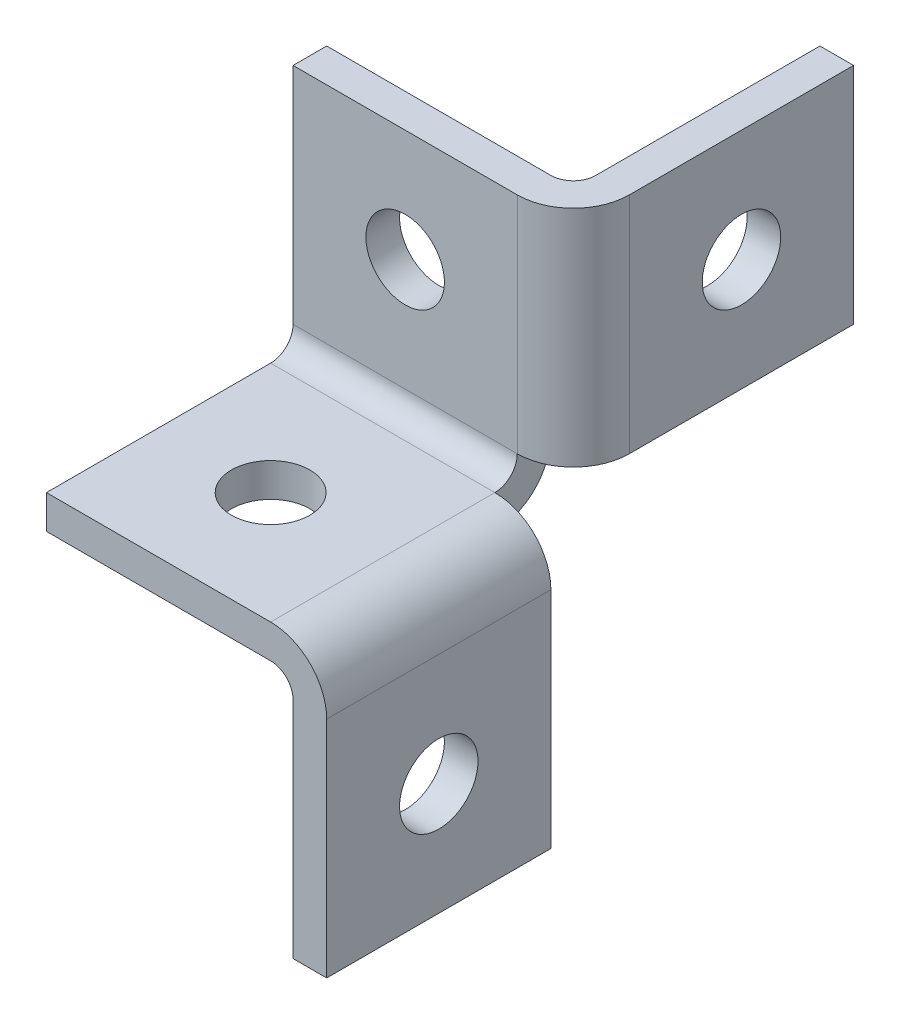
ISO-10303-21;
HEADER;
FILE_DESCRIPTION(('STEP AP214'),'2;1');
FILE_NAME('part.step','',(''),(''),'','','');
FILE_SCHEMA(('AUTOMOTIVE_DESIGN { 1 0 10303 214 1 1 1 1 }'));
ENDSEC;
DATA;
#1=APPLICATION_CONTEXT('core data for automotive mechanical design processes');
#2=APPLICATION_PROTOCOL_DEFINITION('international standard','automotive_design',2000,#1);
#3=PRODUCT_CONTEXT('',#1,'mechanical');
#4=PRODUCT('Part','Part','',(#3));
#5=PRODUCT_RELATED_PRODUCT_CATEGORY('part','',(#4));
#6=PRODUCT_DEFINITION_FORMATION('','',#4);
#7=PRODUCT_DEFINITION_CONTEXT('part definition',#1,'design');
#8=PRODUCT_DEFINITION('design','',#6,#7);
#9=PRODUCT_DEFINITION_SHAPE('','',#8);
#10=(LENGTH_UNIT() NAMED_UNIT(*) SI_UNIT(.MILLI.,.METRE.));
#11=(NAMED_UNIT(*) PLANE_ANGLE_UNIT() SI_UNIT($,.RADIAN.));
#12=(NAMED_UNIT(*) SI_UNIT($,.STERADIAN.) SOLID_ANGLE_UNIT());
#13=UNCERTAINTY_MEASURE_WITH_UNIT(LENGTH_MEASURE(1.E-05),#10,'distance_accuracy_value','');
#14=(GEOMETRIC_REPRESENTATION_CONTEXT(3) GLOBAL_UNCERTAINTY_ASSIGNED_CONTEXT((#13)) GLOBAL_UNIT_ASSIGNED_CONTEXT((#10,
#11,#12)) REPRESENTATION_CONTEXT('',''));
#15=CARTESIAN_POINT('',(0.,0.,0.));
#16=DIRECTION('',(0.,0.,1.));
#17=DIRECTION('',(1.,0.,0.));
#18=AXIS2_PLACEMENT_3D('',#15,#16,#17);
#19=CARTESIAN_POINT('',(-92.0281662206482,-24.0000000000001,-20.));
#20=DIRECTION('',(1.,0.,0.));
#21=DIRECTION('',(0.,1.,0.));
#22=AXIS2_PLACEMENT_3D('',#19,#20,#21);
#23=CYLINDRICAL_SURFACE('',#22,6.99999999999999);
#24=CARTESIAN_POINT('',(49.9999999999997,-23.9999999999998,-20.0000000000001));
#25=DIRECTION('',(1.,0.,0.));
#26=DIRECTION('',(0.,1.,0.));
#27=AXIS2_PLACEMENT_3D('',#24,#25,#26);
#28=CIRCLE('',#27,6.99999999999999);
#29=CARTESIAN_POINT('',(49.9999999999996,-16.9999999999998,-20.0000000000001));
#30=VERTEX_POINT('',#29);
#31=EDGE_CURVE('E137',#30,#30,#28,.F.);
#32=ORIENTED_EDGE('',*,*,#31,.F.);
#33=EDGE_LOOP('',(#32));
#34=FACE_BOUND('',#33,.T.);
#35=CARTESIAN_POINT('',(43.9999999999995,-23.9999999999998,-20.0000000000001));
#36=DIRECTION('',(1.,0.,0.));
#37=DIRECTION('',(0.,1.,0.));
#38=AXIS2_PLACEMENT_3D('',#35,#36,#37);
#39=CIRCLE('',#38,6.99999999999999);
#40=CARTESIAN_POINT('',(43.9999999999995,-16.9999999999999,-20.0000000000001));
#41=VERTEX_POINT('',#40);
#42=EDGE_CURVE('E20',#41,#41,#39,.T.);
#43=ORIENTED_EDGE('',*,*,#42,.F.);
#44=EDGE_LOOP('',(#43));
#45=FACE_BOUND('',#44,.T.);
#46=ADVANCED_FACE('F17',(#34,#45),#23,.F.);
#47=CARTESIAN_POINT('',(161.62652762026,30.0000000000004,-74.0000000000002));
#48=DIRECTION('',(-1.,0.,0.));
#49=DIRECTION('',(0.,-1.,0.));
#50=AXIS2_PLACEMENT_3D('',#47,#48,#49);
#51=CYLINDRICAL_SURFACE('',#50,6.99999999999999);
#52=CARTESIAN_POINT('',(43.9999999999995,30.0000000000002,-74.0000000000001));
#53=DIRECTION('',(-1.,0.,0.));
#54=DIRECTION('',(0.,-1.,0.));
#55=AXIS2_PLACEMENT_3D('',#52,#53,#54);
#56=CIRCLE('',#55,6.99999999999999);
#57=CARTESIAN_POINT('',(43.9999999999995,23.0000000000002,-74.0000000000001));
#58=VERTEX_POINT('',#57);
#59=EDGE_CURVE('E176',#58,#58,#56,.F.);
#60=ORIENTED_EDGE('',*,*,#59,.F.);
#61=EDGE_LOOP('',(#60));
#62=FACE_BOUND('',#61,.T.);
#63=CARTESIAN_POINT('',(49.9999999999994,30.0000000000002,-74.0000000000001));
#64=DIRECTION('',(-1.,0.,0.));
#65=DIRECTION('',(0.,-1.,0.));
#66=AXIS2_PLACEMENT_3D('',#63,#64,#65);
#67=CIRCLE('',#66,6.99999999999999);
#68=CARTESIAN_POINT('',(49.9999999999994,23.0000000000002,-74.0000000000001));
#69=VERTEX_POINT('',#68);
#70=EDGE_CURVE('E194',#69,#69,#67,.T.);
#71=ORIENTED_EDGE('',*,*,#70,.F.);
#72=EDGE_LOOP('',(#71));
#73=FACE_BOUND('',#72,.T.);
#74=ADVANCED_FACE('F288',(#62,#73),#51,.F.);
#75=CARTESIAN_POINT('',(39.9999999999995,-3.99999999999985,-13.5207198547634));
#76=DIRECTION('',(0.,0.,-1.));
#77=DIRECTION('',(0.,1.,0.));
#78=AXIS2_PLACEMENT_3D('',#75,#76,#77);
#79=CYLINDRICAL_SURFACE('',#78,4.);
#80=CARTESIAN_POINT('',(39.9999999999995,-3.99999999999985,-40.));
#81=DIRECTION('',(0.,0.,-1.));
#82=DIRECTION('',(0.,1.,0.));
#83=AXIS2_PLACEMENT_3D('',#80,#81,#82);
#84=CIRCLE('',#83,4.);
#85=CARTESIAN_POINT('',(43.9999999999996,-3.99999999999985,-40.));
#86=VERTEX_POINT('',#85);
#87=CARTESIAN_POINT('',(39.9999999999995,1.24466409401336E-13,-40.));
#88=VERTEX_POINT('',#87);
#89=EDGE_CURVE('E106',#86,#88,#84,.F.);
#90=ORIENTED_EDGE('',*,*,#89,.F.);
#91=DIRECTION('',(0.,0.,1.));
#92=VECTOR('',#91,1.);
#93=CARTESIAN_POINT('',(43.9999999999995,-3.99999999999985,-40.));
#94=LINE('',#93,#92);
#95=CARTESIAN_POINT('',(43.9999999999995,-3.99999999999985,0.));
#96=VERTEX_POINT('',#95);
#97=EDGE_CURVE('E138',#96,#86,#94,.F.);
#98=ORIENTED_EDGE('',*,*,#97,.F.);
#99=CARTESIAN_POINT('',(39.9999999999995,-3.99999999999985,0.));
#100=DIRECTION('',(0.,0.,-1.));
#101=DIRECTION('',(0.,1.,0.));
#102=AXIS2_PLACEMENT_3D('',#99,#100,#101);
#103=CIRCLE('',#102,4.);
#104=CARTESIAN_POINT('',(39.9999999999995,1.05818132034585E-13,0.));
#105=VERTEX_POINT('',#104);
#106=EDGE_CURVE('E149',#105,#96,#103,.T.);
#107=ORIENTED_EDGE('',*,*,#106,.F.);
#108=DIRECTION('',(0.,0.,1.));
#109=VECTOR('',#108,1.);
#110=CARTESIAN_POINT('',(39.9999999999995,1.4210854715202E-13,12.9585602904733));
#111=LINE('',#110,#109);
#112=EDGE_CURVE('E166',#88,#105,#111,.T.);
#113=ORIENTED_EDGE('',*,*,#112,.F.);
#114=EDGE_LOOP('',(#90,#98,#107,#113));
#115=FACE_BOUND('',#114,.T.);
#116=ADVANCED_FACE('F292',(#115),#79,.F.);
#117=CARTESIAN_POINT('',(43.9999999999995,1.4210854715202E-13,-40.));
#118=DIRECTION('',(-1.,0.,0.));
#119=DIRECTION('',(0.,-1.,0.));
#120=AXIS2_PLACEMENT_3D('',#117,#118,#119);
#121=PLANE('',#120);
#122=DIRECTION('',(0.,0.,1.));
#123=VECTOR('',#122,1.);
#124=CARTESIAN_POINT('',(43.9999999999998,-43.9999999999998,-20.0000000000001));
#125=LINE('',#124,#123);
#126=CARTESIAN_POINT('',(43.9999999999997,-43.9999999999998,-40.));
#127=VERTEX_POINT('',#126);
#128=CARTESIAN_POINT('',(43.9999999999996,-43.9999999999998,0.));
#129=VERTEX_POINT('',#128);
#130=EDGE_CURVE('E114',#127,#129,#125,.T.);
#131=ORIENTED_EDGE('',*,*,#130,.T.);
#132=DIRECTION('',(0.,1.,0.));
#133=VECTOR('',#132,1.);
#134=CARTESIAN_POINT('',(43.9999999999995,6.00000000000016,0.));
#135=LINE('',#134,#133);
#136=EDGE_CURVE('E132',#96,#129,#135,.F.);
#137=ORIENTED_EDGE('',*,*,#136,.F.);
#138=ORIENTED_EDGE('',*,*,#97,.T.);
#139=DIRECTION('',(0.,1.,0.));
#140=VECTOR('',#139,1.);
#141=CARTESIAN_POINT('',(43.9999999999998,6.00000000000016,-40.));
#142=LINE('',#141,#140);
#143=EDGE_CURVE('E135',#127,#86,#142,.T.);
#144=ORIENTED_EDGE('',*,*,#143,.F.);
#145=EDGE_LOOP('',(#131,#137,#138,#144));
#146=FACE_BOUND('',#145,.T.);
#147=ORIENTED_EDGE('',*,*,#42,.T.);
#148=EDGE_LOOP('',(#147));
#149=FACE_BOUND('',#148,.T.);
#150=ADVANCED_FACE('F129',(#146,#149),#121,.T.);
#151=CARTESIAN_POINT('',(46.9999999999997,-43.9999999999998,-20.0000000000001));
#152=DIRECTION('',(0.,1.,0.));
#153=DIRECTION('',(-1.,0.,0.));
#154=AXIS2_PLACEMENT_3D('',#151,#152,#153);
#155=PLANE('',#154);
#156=DIRECTION('',(1.,0.,0.));
#157=VECTOR('',#156,1.);
#158=CARTESIAN_POINT('',(39.9999999999995,-43.9999999999998,0.));
#159=LINE('',#158,#157);
#160=CARTESIAN_POINT('',(49.9999999999997,-43.9999999999998,0.));
#161=VERTEX_POINT('',#160);
#162=EDGE_CURVE('E141',#129,#161,#159,.T.);
#163=ORIENTED_EDGE('',*,*,#162,.F.);
#164=ORIENTED_EDGE('',*,*,#130,.F.);
#165=DIRECTION('',(-1.,0.,0.));
#166=VECTOR('',#165,1.);
#167=CARTESIAN_POINT('',(39.9999999999995,-43.9999999999998,-40.));
#168=LINE('',#167,#166);
#169=CARTESIAN_POINT('',(49.9999999999997,-43.9999999999998,-40.));
#170=VERTEX_POINT('',#169);
#171=EDGE_CURVE('E207',#170,#127,#168,.T.);
#172=ORIENTED_EDGE('',*,*,#171,.F.);
#173=DIRECTION('',(0.,0.,1.));
#174=VECTOR('',#173,1.);
#175=CARTESIAN_POINT('',(49.9999999999997,-43.9999999999998,-20.0000000000001));
#176=LINE('',#175,#174);
#177=EDGE_CURVE('E122',#161,#170,#176,.F.);
#178=ORIENTED_EDGE('',*,*,#177,.F.);
#179=EDGE_LOOP('',(#163,#164,#172,#178));
#180=FACE_BOUND('',#179,.T.);
#181=ADVANCED_FACE('F142',(#180),#155,.F.);
#182=CARTESIAN_POINT('',(49.9999999999996,3.00000000000012,-20.0000000000001));
#183=DIRECTION('',(1.,0.,0.));
#184=DIRECTION('',(0.,1.,0.));
#185=AXIS2_PLACEMENT_3D('',#182,#183,#184);
#186=PLANE('',#185);
#187=ORIENTED_EDGE('',*,*,#177,.T.);
#188=DIRECTION('',(0.,1.,0.));
#189=VECTOR('',#188,1.);
#190=CARTESIAN_POINT('',(49.9999999999996,6.00000000000016,-40.));
#191=LINE('',#190,#189);
#192=CARTESIAN_POINT('',(49.9999999999996,-3.99999999999985,-40.));
#193=VERTEX_POINT('',#192);
#194=EDGE_CURVE('E210',#193,#170,#191,.F.);
#195=ORIENTED_EDGE('',*,*,#194,.F.);
#196=DIRECTION('',(0.,0.,1.));
#197=VECTOR('',#196,1.);
#198=CARTESIAN_POINT('',(49.9999999999995,-3.99999999999985,-32.));
#199=LINE('',#198,#197);
#200=CARTESIAN_POINT('',(49.9999999999996,-3.99999999999985,0.));
#201=VERTEX_POINT('',#200);
#202=EDGE_CURVE('E213',#201,#193,#199,.F.);
#203=ORIENTED_EDGE('',*,*,#202,.F.);
#204=DIRECTION('',(0.,1.,0.));
#205=VECTOR('',#204,1.);
#206=CARTESIAN_POINT('',(49.9999999999996,6.00000000000016,0.));
#207=LINE('',#206,#205);
#208=EDGE_CURVE('E145',#161,#201,#207,.T.);
#209=ORIENTED_EDGE('',*,*,#208,.F.);
#210=EDGE_LOOP('',(#187,#195,#203,#209));
#211=FACE_BOUND('',#210,.T.);
#212=ORIENTED_EDGE('',*,*,#31,.T.);
#213=EDGE_LOOP('',(#212));
#214=FACE_BOUND('',#213,.T.);
#215=ADVANCED_FACE('F284',(#211,#214),#186,.T.);
#216=CARTESIAN_POINT('',(19.9999999999994,117.626527620261,-20.0000000000001));
#217=DIRECTION('',(0.,-1.,0.));
#218=DIRECTION('',(1.,0.,0.));
#219=AXIS2_PLACEMENT_3D('',#216,#217,#218);
#220=CYLINDRICAL_SURFACE('',#219,6.99999999999999);
#221=CARTESIAN_POINT('',(19.9999999999996,1.11022302462516E-13,-20.));
#222=DIRECTION('',(0.,-1.,0.));
#223=DIRECTION('',(1.,0.,0.));
#224=AXIS2_PLACEMENT_3D('',#221,#222,#223);
#225=CIRCLE('',#224,6.99999999999999);
#226=CARTESIAN_POINT('',(26.9999999999996,1.23581098283937E-13,-20.));
#227=VERTEX_POINT('',#226);
#228=EDGE_CURVE('E160',#227,#227,#225,.F.);
#229=ORIENTED_EDGE('',*,*,#228,.F.);
#230=EDGE_LOOP('',(#229));
#231=FACE_BOUND('',#230,.T.);
#232=CARTESIAN_POINT('',(19.9999999999996,6.00000000000012,-20.));
#233=DIRECTION('',(0.,-1.,0.));
#234=DIRECTION('',(1.,0.,0.));
#235=AXIS2_PLACEMENT_3D('',#232,#233,#234);
#236=CIRCLE('',#235,6.99999999999999);
#237=CARTESIAN_POINT('',(26.9999999999996,6.00000000000013,-20.));
#238=VERTEX_POINT('',#237);
#239=EDGE_CURVE('E205',#238,#238,#236,.T.);
#240=ORIENTED_EDGE('',*,*,#239,.F.);
#241=EDGE_LOOP('',(#240));
#242=FACE_BOUND('',#241,.T.);
#243=ADVANCED_FACE('F378',(#231,#242),#220,.F.);
#244=CARTESIAN_POINT('',(39.9999999999995,-3.99999999999985,-32.));
#245=DIRECTION('',(0.,0.,1.));
#246=DIRECTION('',(1.,0.,0.));
#247=AXIS2_PLACEMENT_3D('',#244,#245,#246);
#248=CYLINDRICAL_SURFACE('',#247,10.);
#249=DIRECTION('',(0.,0.,1.));
#250=VECTOR('',#249,1.);
#251=CARTESIAN_POINT('',(39.9999999999995,6.00000000000016,-44.));
#252=LINE('',#251,#250);
#253=CARTESIAN_POINT('',(39.9999999999995,6.00000000000016,0.));
#254=VERTEX_POINT('',#253);
#255=CARTESIAN_POINT('',(39.9999999999995,6.00000000000013,-40.));
#256=VERTEX_POINT('',#255);
#257=EDGE_CURVE('E202',#254,#256,#252,.F.);
#258=ORIENTED_EDGE('',*,*,#257,.F.);
#259=CARTESIAN_POINT('',(39.9999999999995,-3.99999999999985,0.));
#260=DIRECTION('',(0.,0.,1.));
#261=DIRECTION('',(1.,0.,0.));
#262=AXIS2_PLACEMENT_3D('',#259,#260,#261);
#263=CIRCLE('',#262,10.);
#264=EDGE_CURVE('E271',#201,#254,#263,.T.);
#265=ORIENTED_EDGE('',*,*,#264,.F.);
#266=ORIENTED_EDGE('',*,*,#202,.T.);
#267=CARTESIAN_POINT('',(39.9999999999995,-3.99999999999985,-40.));
#268=DIRECTION('',(0.,0.,1.));
#269=DIRECTION('',(1.,0.,0.));
#270=AXIS2_PLACEMENT_3D('',#267,#268,#269);
#271=CIRCLE('',#270,10.);
#272=EDGE_CURVE('E201',#256,#193,#271,.F.);
#273=ORIENTED_EDGE('',*,*,#272,.F.);
#274=EDGE_LOOP('',(#258,#265,#266,#273));
#275=FACE_BOUND('',#274,.T.);
#276=ADVANCED_FACE('F374',(#275),#248,.T.);
#277=CARTESIAN_POINT('',(39.9999999999995,6.00000000000016,-40.));
#278=DIRECTION('',(0.,0.,-1.));
#279=DIRECTION('',(-1.,0.,0.));
#280=AXIS2_PLACEMENT_3D('',#277,#278,#279);
#281=PLANE('',#280);
#282=DIRECTION('',(0.,-1.,0.));
#283=VECTOR('',#282,1.);
#284=CARTESIAN_POINT('',(39.9999999999995,30.4947167436454,-40.));
#285=LINE('',#284,#283);
#286=EDGE_CURVE('E656',#88,#256,#285,.F.);
#287=ORIENTED_EDGE('',*,*,#286,.T.);
#288=ORIENTED_EDGE('',*,*,#272,.T.);
#289=ORIENTED_EDGE('',*,*,#194,.T.);
#290=ORIENTED_EDGE('',*,*,#171,.T.);
#291=ORIENTED_EDGE('',*,*,#143,.T.);
#292=ORIENTED_EDGE('',*,*,#89,.T.);
#293=EDGE_LOOP('',(#287,#288,#289,#290,#291,#292));
#294=FACE_BOUND('',#293,.T.);
#295=ADVANCED_FACE('F370',(#294),#281,.T.);
#296=CARTESIAN_POINT('',(39.9999999999995,10.0000000000001,-50.0000000000001));
#297=DIRECTION('',(0.,-1.,0.));
#298=DIRECTION('',(1.,0.,0.));
#299=AXIS2_PLACEMENT_3D('',#296,#297,#298);
#300=PLANE('',#299);
#301=DIRECTION('',(0.,0.,1.));
#302=VECTOR('',#301,1.);
#303=CARTESIAN_POINT('',(49.9999999999994,10.0000000000001,-47.));
#304=LINE('',#303,#302);
#305=CARTESIAN_POINT('',(49.9999999999994,10.0000000000001,-54.0000000000001));
#306=VERTEX_POINT('',#305);
#307=CARTESIAN_POINT('',(49.9999999999994,10.0000000000001,-94.0000000000002));
#308=VERTEX_POINT('',#307);
#309=EDGE_CURVE('E200',#306,#308,#304,.F.);
#310=ORIENTED_EDGE('',*,*,#309,.F.);
#311=CARTESIAN_POINT('',(39.9999999999996,10.0000000000001,-54.0000000000001));
#312=DIRECTION('',(0.,-1.,0.));
#313=DIRECTION('',(1.,0.,0.));
#314=AXIS2_PLACEMENT_3D('',#311,#312,#313);
#315=CIRCLE('',#314,10.);
#316=CARTESIAN_POINT('',(39.9999999999995,10.0000000000001,-44.0000000000001));
#317=VERTEX_POINT('',#316);
#318=EDGE_CURVE('E260',#317,#306,#315,.F.);
#319=ORIENTED_EDGE('',*,*,#318,.F.);
#320=DIRECTION('',(0.,0.,1.));
#321=VECTOR('',#320,1.);
#322=CARTESIAN_POINT('',(39.9999999999995,10.0000000000001,-30.9633289810762));
#323=LINE('',#322,#321);
#324=CARTESIAN_POINT('',(39.9999999999995,10.0000000000001,-50.0000000000001));
#325=VERTEX_POINT('',#324);
#326=EDGE_CURVE('E268',#317,#325,#323,.F.);
#327=ORIENTED_EDGE('',*,*,#326,.T.);
#328=CARTESIAN_POINT('',(39.9999999999996,10.0000000000001,-54.0000000000001));
#329=DIRECTION('',(0.,1.,0.));
#330=DIRECTION('',(-1.,0.,0.));
#331=AXIS2_PLACEMENT_3D('',#328,#329,#330);
#332=CIRCLE('',#331,4.);
#333=CARTESIAN_POINT('',(43.9999999999996,10.0000000000002,-54.0000000000001));
#334=VERTEX_POINT('',#333);
#335=EDGE_CURVE('E175',#325,#334,#332,.T.);
#336=ORIENTED_EDGE('',*,*,#335,.T.);
#337=DIRECTION('',(0.,0.,1.));
#338=VECTOR('',#337,1.);
#339=CARTESIAN_POINT('',(43.9999999999996,10.0000000000001,-50.0000000000001));
#340=LINE('',#339,#338);
#341=CARTESIAN_POINT('',(43.9999999999996,10.0000000000001,-94.0000000000002));
#342=VERTEX_POINT('',#341);
#343=EDGE_CURVE('E180',#342,#334,#340,.T.);
#344=ORIENTED_EDGE('',*,*,#343,.F.);
#345=DIRECTION('',(-1.,0.,0.));
#346=VECTOR('',#345,1.);
#347=CARTESIAN_POINT('',(46.9999999999995,10.0000000000001,-94.0000000000002));
#348=LINE('',#347,#346);
#349=EDGE_CURVE('E181',#308,#342,#348,.T.);
#350=ORIENTED_EDGE('',*,*,#349,.F.);
#351=EDGE_LOOP('',(#310,#319,#327,#336,#344,#350));
#352=FACE_BOUND('',#351,.T.);
#353=ADVANCED_FACE('F366',(#352),#300,.T.);
#354=CARTESIAN_POINT('',(49.9999999999994,30.0000000000001,-47.));
#355=DIRECTION('',(1.,0.,0.));
#356=DIRECTION('',(0.,1.,0.));
#357=AXIS2_PLACEMENT_3D('',#354,#355,#356);
#358=PLANE('',#357);
#359=ORIENTED_EDGE('',*,*,#70,.T.);
#360=EDGE_LOOP('',(#359));
#361=FACE_BOUND('',#360,.T.);
#362=DIRECTION('',(0.,1.,0.));
#363=VECTOR('',#362,1.);
#364=CARTESIAN_POINT('',(49.9999999999994,30.0000000000001,-94.0000000000002));
#365=LINE('',#364,#363);
#366=CARTESIAN_POINT('',(49.9999999999994,50.0000000000002,-94.0000000000002));
#367=VERTEX_POINT('',#366);
#368=EDGE_CURVE('E191',#367,#308,#365,.F.);
#369=ORIENTED_EDGE('',*,*,#368,.F.);
#370=DIRECTION('',(0.,0.,1.));
#371=VECTOR('',#370,1.);
#372=CARTESIAN_POINT('',(49.9999999999994,50.0000000000002,-50.0000000000001));
#373=LINE('',#372,#371);
#374=CARTESIAN_POINT('',(49.9999999999994,50.0000000000001,-54.0000000000001));
#375=VERTEX_POINT('',#374);
#376=EDGE_CURVE('E188',#375,#367,#373,.F.);
#377=ORIENTED_EDGE('',*,*,#376,.F.);
#378=DIRECTION('',(0.,1.,0.));
#379=VECTOR('',#378,1.);
#380=CARTESIAN_POINT('',(49.9999999999994,30.0000000000001,-54.0000000000001));
#381=LINE('',#380,#379);
#382=EDGE_CURVE('E197',#375,#306,#381,.F.);
#383=ORIENTED_EDGE('',*,*,#382,.T.);
#384=ORIENTED_EDGE('',*,*,#309,.T.);
#385=EDGE_LOOP('',(#369,#377,#383,#384));
#386=FACE_BOUND('',#385,.T.);
#387=ADVANCED_FACE('F362',(#361,#386),#358,.T.);
#388=CARTESIAN_POINT('',(46.9999999999995,30.0000000000001,-94.0000000000002));
#389=DIRECTION('',(0.,0.,-1.));
#390=DIRECTION('',(-1.,0.,0.));
#391=AXIS2_PLACEMENT_3D('',#388,#389,#390);
#392=PLANE('',#391);
#393=ORIENTED_EDGE('',*,*,#368,.T.);
#394=ORIENTED_EDGE('',*,*,#349,.T.);
#395=DIRECTION('',(0.,-1.,0.));
#396=VECTOR('',#395,1.);
#397=CARTESIAN_POINT('',(43.9999999999995,85.8746517399161,-94.0000000000002));
#398=LINE('',#397,#396);
#399=CARTESIAN_POINT('',(43.9999999999995,50.0000000000002,-94.0000000000002));
#400=VERTEX_POINT('',#399);
#401=EDGE_CURVE('E177',#400,#342,#398,.T.);
#402=ORIENTED_EDGE('',*,*,#401,.F.);
#403=DIRECTION('',(-1.,0.,0.));
#404=VECTOR('',#403,1.);
#405=CARTESIAN_POINT('',(39.9999999999995,50.0000000000001,-94.0000000000002));
#406=LINE('',#405,#404);
#407=EDGE_CURVE('E184',#367,#400,#406,.T.);
#408=ORIENTED_EDGE('',*,*,#407,.F.);
#409=EDGE_LOOP('',(#393,#394,#402,#408));
#410=FACE_BOUND('',#409,.T.);
#411=ADVANCED_FACE('F358',(#410),#392,.T.);
#412=CARTESIAN_POINT('',(43.9999999999995,85.8746517399161,-50.0000000000001));
#413=DIRECTION('',(-1.,0.,0.));
#414=DIRECTION('',(0.,-1.,0.));
#415=AXIS2_PLACEMENT_3D('',#412,#413,#414);
#416=PLANE('',#415);
#417=ORIENTED_EDGE('',*,*,#59,.T.);
#418=EDGE_LOOP('',(#417));
#419=FACE_BOUND('',#418,.T.);
#420=ORIENTED_EDGE('',*,*,#401,.T.);
#421=ORIENTED_EDGE('',*,*,#343,.T.);
#422=DIRECTION('',(0.,1.,0.));
#423=VECTOR('',#422,1.);
#424=CARTESIAN_POINT('',(43.9999999999995,42.9373258699581,-54.0000000000001));
#425=LINE('',#424,#423);
#426=CARTESIAN_POINT('',(43.9999999999995,50.0000000000001,-54.0000000000001));
#427=VERTEX_POINT('',#426);
#428=EDGE_CURVE('E172',#334,#427,#425,.T.);
#429=ORIENTED_EDGE('',*,*,#428,.T.);
#430=DIRECTION('',(0.,0.,1.));
#431=VECTOR('',#430,1.);
#432=CARTESIAN_POINT('',(43.9999999999995,50.0000000000002,-50.0000000000001));
#433=LINE('',#432,#431);
#434=EDGE_CURVE('E187',#400,#427,#433,.T.);
#435=ORIENTED_EDGE('',*,*,#434,.F.);
#436=EDGE_LOOP('',(#420,#421,#429,#435));
#437=FACE_BOUND('',#436,.T.);
#438=ADVANCED_FACE('F354',(#419,#437),#416,.T.);
#439=CARTESIAN_POINT('',(39.9999999999995,42.9373258699581,-54.0000000000001));
#440=DIRECTION('',(0.,1.,0.));
#441=DIRECTION('',(-1.,0.,0.));
#442=AXIS2_PLACEMENT_3D('',#439,#440,#441);
#443=CYLINDRICAL_SURFACE('',#442,4.);
#444=ORIENTED_EDGE('',*,*,#335,.F.);
#445=DIRECTION('',(0.,1.,0.));
#446=VECTOR('',#445,1.);
#447=CARTESIAN_POINT('',(39.9999999999995,1.06581410364015E-13,-50.0000000000001));
#448=LINE('',#447,#446);
#449=CARTESIAN_POINT('',(39.9999999999995,50.0000000000001,-50.0000000000001));
#450=VERTEX_POINT('',#449);
#451=EDGE_CURVE('E167',#450,#325,#448,.F.);
#452=ORIENTED_EDGE('',*,*,#451,.F.);
#453=CARTESIAN_POINT('',(39.9999999999995,50.0000000000001,-54.0000000000001));
#454=DIRECTION('',(0.,1.,0.));
#455=DIRECTION('',(-1.,0.,0.));
#456=AXIS2_PLACEMENT_3D('',#453,#454,#455);
#457=CIRCLE('',#456,4.);
#458=EDGE_CURVE('E257',#427,#450,#457,.F.);
#459=ORIENTED_EDGE('',*,*,#458,.F.);
#460=ORIENTED_EDGE('',*,*,#428,.F.);
#461=EDGE_LOOP('',(#444,#452,#459,#460));
#462=FACE_BOUND('',#461,.T.);
#463=ADVANCED_FACE('F350',(#462),#443,.F.);
#464=CARTESIAN_POINT('',(39.9999999999995,1.4210854715202E-13,12.9585602904733));
#465=DIRECTION('',(0.,-1.,0.));
#466=DIRECTION('',(1.,0.,0.));
#467=AXIS2_PLACEMENT_3D('',#464,#465,#466);
#468=PLANE('',#467);
#469=ORIENTED_EDGE('',*,*,#228,.T.);
#470=EDGE_LOOP('',(#469));
#471=FACE_BOUND('',#470,.T.);
#472=DIRECTION('',(0.,0.,1.));
#473=VECTOR('',#472,1.);
#474=CARTESIAN_POINT('',(-4.21044280236538E-13,0.,-34.68));
#475=LINE('',#474,#473);
#476=CARTESIAN_POINT('',(-4.17771406646422E-13,0.,-40.));
#477=VERTEX_POINT('',#476);
#478=CARTESIAN_POINT('',(-4.18097203314798E-13,0.,0.));
#479=VERTEX_POINT('',#478);
#480=EDGE_CURVE('E255',#477,#479,#475,.T.);
#481=ORIENTED_EDGE('',*,*,#480,.F.);
#482=DIRECTION('',(1.,0.,0.));
#483=VECTOR('',#482,1.);
#484=CARTESIAN_POINT('',(39.9999999999995,1.3562320820992E-13,-40.));
#485=LINE('',#484,#483);
#486=EDGE_CURVE('E163',#477,#88,#485,.T.);
#487=ORIENTED_EDGE('',*,*,#486,.T.);
#488=ORIENTED_EDGE('',*,*,#112,.T.);
#489=DIRECTION('',(1.,0.,0.));
#490=VECTOR('',#489,1.);
#491=CARTESIAN_POINT('',(39.9999999999995,0.,0.));
#492=LINE('',#491,#490);
#493=EDGE_CURVE('E151',#479,#105,#492,.T.);
#494=ORIENTED_EDGE('',*,*,#493,.F.);
#495=EDGE_LOOP('',(#481,#487,#488,#494));
#496=FACE_BOUND('',#495,.T.);
#497=ADVANCED_FACE('F347',(#471,#496),#468,.T.);
#498=CARTESIAN_POINT('',(39.9999999999995,6.00000000000016,0.));
#499=DIRECTION('',(0.,0.,1.));
#500=DIRECTION('',(1.,0.,0.));
#501=AXIS2_PLACEMENT_3D('',#498,#499,#500);
#502=PLANE('',#501);
#503=ORIENTED_EDGE('',*,*,#208,.T.);
#504=ORIENTED_EDGE('',*,*,#264,.T.);
#505=DIRECTION('',(-1.,0.,0.));
#506=VECTOR('',#505,1.);
#507=CARTESIAN_POINT('',(39.9999999999995,6.00000000000016,0.));
#508=LINE('',#507,#506);
#509=CARTESIAN_POINT('',(-4.25273658069895E-13,6.00000000000008,0.));
#510=VERTEX_POINT('',#509);
#511=EDGE_CURVE('E171',#510,#254,#508,.F.);
#512=ORIENTED_EDGE('',*,*,#511,.F.);
#513=DIRECTION('',(0.,-1.,0.));
#514=VECTOR('',#513,1.);
#515=CARTESIAN_POINT('',(-4.42995362615051E-13,15.3200000000001,0.));
#516=LINE('',#515,#514);
#517=EDGE_CURVE('E667',#479,#510,#516,.F.);
#518=ORIENTED_EDGE('',*,*,#517,.F.);
#519=ORIENTED_EDGE('',*,*,#493,.T.);
#520=ORIENTED_EDGE('',*,*,#106,.T.);
#521=ORIENTED_EDGE('',*,*,#136,.T.);
#522=ORIENTED_EDGE('',*,*,#162,.T.);
#523=EDGE_LOOP('',(#503,#504,#512,#518,#519,#520,#521,#522));
#524=FACE_BOUND('',#523,.T.);
#525=ADVANCED_FACE('F147',(#524),#502,.T.);
#526=CARTESIAN_POINT('',(39.9999999999995,6.00000000000016,-44.));
#527=DIRECTION('',(0.,1.,0.));
#528=DIRECTION('',(-1.,0.,0.));
#529=AXIS2_PLACEMENT_3D('',#526,#527,#528);
#530=PLANE('',#529);
#531=DIRECTION('',(0.,0.,1.));
#532=VECTOR('',#531,1.);
#533=CARTESIAN_POINT('',(-4.31808962369185E-13,6.00000000000008,-34.68));
#534=LINE('',#533,#532);
#535=CARTESIAN_POINT('',(-4.30092641616653E-13,6.00000000000007,-40.));
#536=VERTEX_POINT('',#535);
#537=EDGE_CURVE('E670',#510,#536,#534,.F.);
#538=ORIENTED_EDGE('',*,*,#537,.F.);
#539=ORIENTED_EDGE('',*,*,#511,.T.);
#540=ORIENTED_EDGE('',*,*,#257,.T.);
#541=DIRECTION('',(1.,0.,0.));
#542=VECTOR('',#541,1.);
#543=CARTESIAN_POINT('',(39.9999999999995,6.00000000000013,-40.));
#544=LINE('',#543,#542);
#545=EDGE_CURVE('E265',#256,#536,#544,.F.);
#546=ORIENTED_EDGE('',*,*,#545,.T.);
#547=EDGE_LOOP('',(#538,#539,#540,#546));
#548=FACE_BOUND('',#547,.T.);
#549=ORIENTED_EDGE('',*,*,#239,.T.);
#550=EDGE_LOOP('',(#549));
#551=FACE_BOUND('',#550,.T.);
#552=ADVANCED_FACE('F340',(#548,#551),#530,.T.);
#553=CARTESIAN_POINT('',(39.9999999999995,1.06581410364015E-13,-50.0000000000001));
#554=DIRECTION('',(0.,0.,-1.));
#555=DIRECTION('',(-1.,0.,0.));
#556=AXIS2_PLACEMENT_3D('',#553,#554,#555);
#557=PLANE('',#556);
#558=DIRECTION('',(0.,-1.,0.));
#559=VECTOR('',#558,1.);
#560=CARTESIAN_POINT('',(-4.50975090604544E-13,15.3200000000001,-50.0000000000001));
#561=LINE('',#560,#559);
#562=CARTESIAN_POINT('',(-5.1328935185054E-13,50.0000000000001,-50.0000000000001));
#563=VERTEX_POINT('',#562);
#564=CARTESIAN_POINT('',(-4.37948288745105E-13,10.,-50.0000000000001));
#565=VERTEX_POINT('',#564);
#566=EDGE_CURVE('E252',#563,#565,#561,.T.);
#567=ORIENTED_EDGE('',*,*,#566,.F.);
#568=DIRECTION('',(-1.,0.,0.));
#569=VECTOR('',#568,1.);
#570=CARTESIAN_POINT('',(39.9999999999995,50.0000000000001,-50.0000000000001));
#571=LINE('',#570,#569);
#572=EDGE_CURVE('E256',#450,#563,#571,.T.);
#573=ORIENTED_EDGE('',*,*,#572,.F.);
#574=ORIENTED_EDGE('',*,*,#451,.T.);
#575=DIRECTION('',(1.,0.,0.));
#576=VECTOR('',#575,1.);
#577=CARTESIAN_POINT('',(39.9999999999995,10.0000000000001,-50.));
#578=LINE('',#577,#576);
#579=EDGE_CURVE('E170',#565,#325,#578,.T.);
#580=ORIENTED_EDGE('',*,*,#579,.F.);
#581=EDGE_LOOP('',(#567,#573,#574,#580));
#582=FACE_BOUND('',#581,.T.);
#583=CARTESIAN_POINT('',(19.9999999999995,30.0000000000001,-50.0000000000001));
#584=DIRECTION('',(0.,0.,-1.));
#585=DIRECTION('',(-1.,0.,0.));
#586=AXIS2_PLACEMENT_3D('',#583,#584,#585);
#587=CIRCLE('',#586,6.99999999999999);
#588=CARTESIAN_POINT('',(12.9999999999995,30.0000000000001,-50.0000000000001));
#589=VERTEX_POINT('',#588);
#590=EDGE_CURVE('E262',#589,#589,#587,.F.);
#591=ORIENTED_EDGE('',*,*,#590,.T.);
#592=EDGE_LOOP('',(#591));
#593=FACE_BOUND('',#592,.T.);
#594=ADVANCED_FACE('F336',(#582,#593),#557,.T.);
#595=CARTESIAN_POINT('',(39.9999999999995,10.0000000000001,-40.));
#596=DIRECTION('',(1.,0.,0.));
#597=DIRECTION('',(0.,1.,0.));
#598=AXIS2_PLACEMENT_3D('',#595,#596,#597);
#599=CYLINDRICAL_SURFACE('',#598,10.);
#600=ORIENTED_EDGE('',*,*,#579,.T.);
#601=CARTESIAN_POINT('',(39.9999999999995,10.0000000000001,-40.));
#602=DIRECTION('',(1.,0.,0.));
#603=DIRECTION('',(0.,1.,0.));
#604=AXIS2_PLACEMENT_3D('',#601,#602,#603);
#605=CIRCLE('',#604,10.);
#606=EDGE_CURVE('E266',#325,#88,#605,.F.);
#607=ORIENTED_EDGE('',*,*,#606,.T.);
#608=ORIENTED_EDGE('',*,*,#486,.F.);
#609=CARTESIAN_POINT('',(-4.37150315946155E-13,10.,-40.));
#610=DIRECTION('',(1.,0.,0.));
#611=DIRECTION('',(0.,1.,0.));
#612=AXIS2_PLACEMENT_3D('',#609,#610,#611);
#613=CIRCLE('',#612,10.);
#614=EDGE_CURVE('E250',#565,#477,#613,.F.);
#615=ORIENTED_EDGE('',*,*,#614,.F.);
#616=EDGE_LOOP('',(#600,#607,#608,#615));
#617=FACE_BOUND('',#616,.T.);
#618=ADVANCED_FACE('F332',(#617),#599,.T.);
#619=CARTESIAN_POINT('',(39.9999999999995,30.4947167436454,-30.9633289810762));
#620=DIRECTION('',(-1.,0.,0.));
#621=DIRECTION('',(0.,-1.,0.));
#622=AXIS2_PLACEMENT_3D('',#619,#620,#621);
#623=PLANE('',#622);
#624=ORIENTED_EDGE('',*,*,#326,.F.);
#625=CARTESIAN_POINT('',(39.9999999999995,10.0000000000001,-40.));
#626=DIRECTION('',(1.,0.,0.));
#627=DIRECTION('',(0.,1.,0.));
#628=AXIS2_PLACEMENT_3D('',#625,#626,#627);
#629=CIRCLE('',#628,4.);
#630=EDGE_CURVE('E247',#317,#256,#629,.F.);
#631=ORIENTED_EDGE('',*,*,#630,.T.);
#632=ORIENTED_EDGE('',*,*,#286,.F.);
#633=ORIENTED_EDGE('',*,*,#606,.F.);
#634=EDGE_LOOP('',(#624,#631,#632,#633));
#635=FACE_BOUND('',#634,.T.);
#636=ADVANCED_FACE('F328',(#635),#623,.F.);
#637=CARTESIAN_POINT('',(19.9999999999996,30.0000000000001,92.0281662206479));
#638=DIRECTION('',(0.,0.,-1.));
#639=DIRECTION('',(-1.,0.,0.));
#640=AXIS2_PLACEMENT_3D('',#637,#638,#639);
#641=CYLINDRICAL_SURFACE('',#640,6.99999999999999);
#642=ORIENTED_EDGE('',*,*,#590,.F.);
#643=EDGE_LOOP('',(#642));
#644=FACE_BOUND('',#643,.T.);
#645=CARTESIAN_POINT('',(19.9999999999995,30.0000000000001,-44.));
#646=DIRECTION('',(0.,0.,-1.));
#647=DIRECTION('',(-1.,0.,0.));
#648=AXIS2_PLACEMENT_3D('',#645,#646,#647);
#649=CIRCLE('',#648,6.99999999999999);
#650=CARTESIAN_POINT('',(12.9999999999995,30.0000000000001,-44.));
#651=VERTEX_POINT('',#650);
#652=EDGE_CURVE('E243',#651,#651,#649,.T.);
#653=ORIENTED_EDGE('',*,*,#652,.F.);
#654=EDGE_LOOP('',(#653));
#655=FACE_BOUND('',#654,.T.);
#656=ADVANCED_FACE('F324',(#644,#655),#641,.F.);
#657=CARTESIAN_POINT('',(39.9999999999995,40.,-54.0000000000001));
#658=DIRECTION('',(0.,-1.,0.));
#659=DIRECTION('',(1.,0.,0.));
#660=AXIS2_PLACEMENT_3D('',#657,#658,#659);
#661=CYLINDRICAL_SURFACE('',#660,10.);
#662=DIRECTION('',(0.,1.,0.));
#663=VECTOR('',#662,1.);
#664=CARTESIAN_POINT('',(39.9999999999995,50.0000000000001,-44.));
#665=LINE('',#664,#663);
#666=CARTESIAN_POINT('',(39.9999999999995,50.0000000000001,-44.));
#667=VERTEX_POINT('',#666);
#668=EDGE_CURVE('E246',#317,#667,#665,.T.);
#669=ORIENTED_EDGE('',*,*,#668,.F.);
#670=ORIENTED_EDGE('',*,*,#318,.T.);
#671=ORIENTED_EDGE('',*,*,#382,.F.);
#672=CARTESIAN_POINT('',(39.9999999999995,50.0000000000001,-54.0000000000001));
#673=DIRECTION('',(0.,-1.,0.));
#674=DIRECTION('',(1.,0.,0.));
#675=AXIS2_PLACEMENT_3D('',#672,#673,#674);
#676=CIRCLE('',#675,10.);
#677=EDGE_CURVE('E253',#667,#375,#676,.F.);
#678=ORIENTED_EDGE('',*,*,#677,.F.);
#679=EDGE_LOOP('',(#669,#670,#671,#678));
#680=FACE_BOUND('',#679,.T.);
#681=ADVANCED_FACE('F320',(#680),#661,.T.);
#682=CARTESIAN_POINT('',(39.9999999999995,50.0000000000001,-50.0000000000001));
#683=DIRECTION('',(0.,1.,0.));
#684=DIRECTION('',(-1.,0.,0.));
#685=AXIS2_PLACEMENT_3D('',#682,#683,#684);
#686=PLANE('',#685);
#687=DIRECTION('',(1.,0.,0.));
#688=VECTOR('',#687,1.);
#689=CARTESIAN_POINT('',(39.9999999999995,50.0000000000001,-44.));
#690=LINE('',#689,#688);
#691=CARTESIAN_POINT('',(-5.13064561250258E-13,50.0000000000001,-44.));
#692=VERTEX_POINT('',#691);
#693=EDGE_CURVE('E653',#667,#692,#690,.F.);
#694=ORIENTED_EDGE('',*,*,#693,.F.);
#695=ORIENTED_EDGE('',*,*,#677,.T.);
#696=ORIENTED_EDGE('',*,*,#376,.T.);
#697=ORIENTED_EDGE('',*,*,#407,.T.);
#698=ORIENTED_EDGE('',*,*,#434,.T.);
#699=ORIENTED_EDGE('',*,*,#458,.T.);
#700=ORIENTED_EDGE('',*,*,#572,.T.);
#701=DIRECTION('',(0.,0.,1.));
#702=VECTOR('',#701,1.);
#703=CARTESIAN_POINT('',(-5.10749964675262E-13,50.0000000000001,-34.68));
#704=LINE('',#703,#702);
#705=EDGE_CURVE('E701',#692,#563,#704,.F.);
#706=ORIENTED_EDGE('',*,*,#705,.F.);
#707=EDGE_LOOP('',(#694,#695,#696,#697,#698,#699,#700,#706));
#708=FACE_BOUND('',#707,.T.);
#709=ADVANCED_FACE('F317',(#708),#686,.T.);
#710=CARTESIAN_POINT('',(-4.48530101948563E-13,15.3200000000001,-34.68));
#711=DIRECTION('',(-1.,0.,0.));
#712=DIRECTION('',(0.,-1.,0.));
#713=AXIS2_PLACEMENT_3D('',#710,#711,#712);
#714=PLANE('',#713);
#715=ORIENTED_EDGE('',*,*,#566,.T.);
#716=ORIENTED_EDGE('',*,*,#614,.T.);
#717=ORIENTED_EDGE('',*,*,#480,.T.);
#718=ORIENTED_EDGE('',*,*,#517,.T.);
#719=ORIENTED_EDGE('',*,*,#537,.T.);
#720=CARTESIAN_POINT('',(-4.37150315946155E-13,10.0000000000001,-40.));
#721=DIRECTION('',(1.,0.,0.));
#722=DIRECTION('',(0.,1.,0.));
#723=AXIS2_PLACEMENT_3D('',#720,#721,#722);
#724=CIRCLE('',#723,4.);
#725=CARTESIAN_POINT('',(-4.75633421537225E-13,10.0000000000001,-44.));
#726=VERTEX_POINT('',#725);
#727=EDGE_CURVE('E35',#536,#726,#724,.T.);
#728=ORIENTED_EDGE('',*,*,#727,.T.);
#729=DIRECTION('',(0.,1.,0.));
#730=VECTOR('',#729,1.);
#731=CARTESIAN_POINT('',(-5.13478148889135E-13,50.0000000000001,-44.));
#732=LINE('',#731,#730);
#733=EDGE_CURVE('E26',#692,#726,#732,.F.);
#734=ORIENTED_EDGE('',*,*,#733,.F.);
#735=ORIENTED_EDGE('',*,*,#705,.T.);
#736=EDGE_LOOP('',(#715,#716,#717,#718,#719,#728,#734,#735));
#737=FACE_BOUND('',#736,.T.);
#738=ADVANCED_FACE('F309',(#737),#714,.T.);
#739=CARTESIAN_POINT('',(39.9999999999995,10.0000000000001,-40.));
#740=DIRECTION('',(1.,0.,0.));
#741=DIRECTION('',(0.,1.,0.));
#742=AXIS2_PLACEMENT_3D('',#739,#740,#741);
#743=CYLINDRICAL_SURFACE('',#742,4.);
#744=ORIENTED_EDGE('',*,*,#630,.F.);
#745=DIRECTION('',(1.,0.,0.));
#746=VECTOR('',#745,1.);
#747=CARTESIAN_POINT('',(39.9999999999995,10.0000000000001,-44.));
#748=LINE('',#747,#746);
#749=EDGE_CURVE('E11',#726,#317,#748,.T.);
#750=ORIENTED_EDGE('',*,*,#749,.F.);
#751=ORIENTED_EDGE('',*,*,#727,.F.);
#752=ORIENTED_EDGE('',*,*,#545,.F.);
#753=EDGE_LOOP('',(#744,#750,#751,#752));
#754=FACE_BOUND('',#753,.T.);
#755=ADVANCED_FACE('F303',(#754),#743,.F.);
#756=CARTESIAN_POINT('',(39.9999999999995,50.0000000000001,-44.));
#757=DIRECTION('',(0.,0.,1.));
#758=DIRECTION('',(1.,0.,0.));
#759=AXIS2_PLACEMENT_3D('',#756,#757,#758);
#760=PLANE('',#759);
#761=ORIENTED_EDGE('',*,*,#733,.T.);
#762=ORIENTED_EDGE('',*,*,#749,.T.);
#763=ORIENTED_EDGE('',*,*,#668,.T.);
#764=ORIENTED_EDGE('',*,*,#693,.T.);
#765=EDGE_LOOP('',(#761,#762,#763,#764));
#766=FACE_BOUND('',#765,.T.);
#767=ORIENTED_EDGE('',*,*,#652,.T.);
#768=EDGE_LOOP('',(#767));
#769=FACE_BOUND('',#768,.T.);
#770=ADVANCED_FACE('F301',(#766,#769),#760,.T.);
#771=CLOSED_SHELL('',(#46,#74,#116,#150,#181,#215,#243,#276,#295,#353,#387,#411,#438,#463,#497,
#525,#552,#594,#618,#636,#656,#681,#709,#738,#755,#770));
#772=MANIFOLD_SOLID_BREP('B1',#771);
#773=ADVANCED_BREP_SHAPE_REPRESENTATION('',(#18,#772),#14);
#774=SHAPE_DEFINITION_REPRESENTATION(#9,#773);
ENDSEC;
END-ISO-10303-21;
